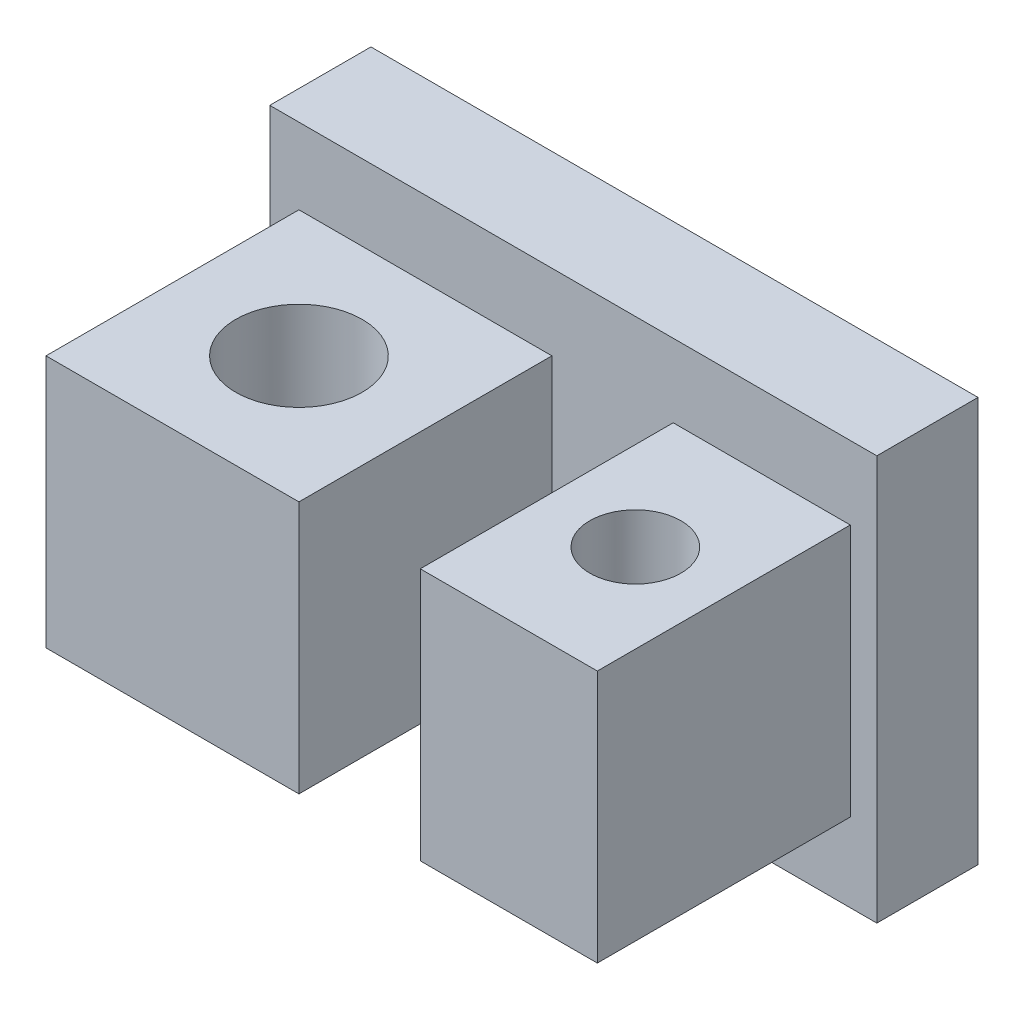
ISO-10303-21;
HEADER;
FILE_DESCRIPTION(('STEP AP214'),'2;1');
FILE_NAME('part.step','',(''),(''),'','','');
FILE_SCHEMA(('AUTOMOTIVE_DESIGN { 1 0 10303 214 1 1 1 1 }'));
ENDSEC;
DATA;
#1=APPLICATION_CONTEXT('core data for automotive mechanical design processes');
#2=APPLICATION_PROTOCOL_DEFINITION('international standard','automotive_design',2000,#1);
#3=PRODUCT_CONTEXT('',#1,'mechanical');
#4=PRODUCT('Part','Part','',(#3));
#5=PRODUCT_RELATED_PRODUCT_CATEGORY('part','',(#4));
#6=PRODUCT_DEFINITION_FORMATION('','',#4);
#7=PRODUCT_DEFINITION_CONTEXT('part definition',#1,'design');
#8=PRODUCT_DEFINITION('design','',#6,#7);
#9=PRODUCT_DEFINITION_SHAPE('','',#8);
#10=(LENGTH_UNIT() NAMED_UNIT(*) SI_UNIT(.MILLI.,.METRE.));
#11=(NAMED_UNIT(*) PLANE_ANGLE_UNIT() SI_UNIT($,.RADIAN.));
#12=(NAMED_UNIT(*) SI_UNIT($,.STERADIAN.) SOLID_ANGLE_UNIT());
#13=UNCERTAINTY_MEASURE_WITH_UNIT(LENGTH_MEASURE(1.E-05),#10,'distance_accuracy_value','');
#14=(GEOMETRIC_REPRESENTATION_CONTEXT(3) GLOBAL_UNCERTAINTY_ASSIGNED_CONTEXT((#13)) GLOBAL_UNIT_ASSIGNED_CONTEXT((#10,
#11,#12)) REPRESENTATION_CONTEXT('',''));
#15=CARTESIAN_POINT('',(0.,0.,0.));
#16=DIRECTION('',(0.,0.,1.));
#17=DIRECTION('',(1.,0.,0.));
#18=AXIS2_PLACEMENT_3D('',#15,#16,#17);
#19=CARTESIAN_POINT('',(0.,0.,2.));
#20=DIRECTION('',(0.,0.,1.));
#21=DIRECTION('',(1.,0.,0.));
#22=AXIS2_PLACEMENT_3D('',#19,#20,#21);
#23=PLANE('',#22);
#24=DIRECTION('',(0.,-1.,0.));
#25=VECTOR('',#24,1.);
#26=CARTESIAN_POINT('',(-4.5418108945163,4.02597402597402,2.));
#27=LINE('',#26,#25);
#28=CARTESIAN_POINT('',(-4.5418108945163,4.02597402597402,2.));
#29=VERTEX_POINT('',#28);
#30=CARTESIAN_POINT('',(-4.5418108945163,-3.97402597402598,2.));
#31=VERTEX_POINT('',#30);
#32=EDGE_CURVE('E227',#29,#31,#27,.T.);
#33=ORIENTED_EDGE('',*,*,#32,.T.);
#34=DIRECTION('',(1.,0.,0.));
#35=VECTOR('',#34,1.);
#36=CARTESIAN_POINT('',(-4.5418108945163,-3.97402597402598,2.));
#37=LINE('',#36,#35);
#38=CARTESIAN_POINT('',(7.4581891054837,-3.97402597402598,2.));
#39=VERTEX_POINT('',#38);
#40=EDGE_CURVE('E231',#31,#39,#37,.T.);
#41=ORIENTED_EDGE('',*,*,#40,.T.);
#42=DIRECTION('',(0.,1.,0.));
#43=VECTOR('',#42,1.);
#44=CARTESIAN_POINT('',(7.4581891054837,4.02597402597402,2.));
#45=LINE('',#44,#43);
#46=CARTESIAN_POINT('',(7.4581891054837,4.02597402597402,2.));
#47=VERTEX_POINT('',#46);
#48=EDGE_CURVE('E235',#39,#47,#45,.T.);
#49=ORIENTED_EDGE('',*,*,#48,.T.);
#50=DIRECTION('',(-1.,0.,0.));
#51=VECTOR('',#50,1.);
#52=CARTESIAN_POINT('',(-4.5418108945163,4.02597402597402,2.));
#53=LINE('',#52,#51);
#54=EDGE_CURVE('E238',#47,#29,#53,.T.);
#55=ORIENTED_EDGE('',*,*,#54,.T.);
#56=EDGE_LOOP('',(#33,#41,#49,#55));
#57=FACE_BOUND('',#56,.T.);
#58=DIRECTION('',(-1.,0.,0.));
#59=VECTOR('',#58,1.);
#60=CARTESIAN_POINT('',(0.,-2.47402597402598,2.));
#61=LINE('',#60,#59);
#62=CARTESIAN_POINT('',(1.03498241264621,-2.47402597402598,2.));
#63=VERTEX_POINT('',#62);
#64=CARTESIAN_POINT('',(-3.96501758735379,-2.47402597402598,2.));
#65=VERTEX_POINT('',#64);
#66=EDGE_CURVE('E218',#63,#65,#61,.T.);
#67=ORIENTED_EDGE('',*,*,#66,.T.);
#68=DIRECTION('',(0.,1.,0.));
#69=VECTOR('',#68,1.);
#70=CARTESIAN_POINT('',(-3.96501758735379,0.,2.));
#71=LINE('',#70,#69);
#72=CARTESIAN_POINT('',(-3.96501758735379,2.52597402597402,2.));
#73=VERTEX_POINT('',#72);
#74=EDGE_CURVE('E222',#65,#73,#71,.T.);
#75=ORIENTED_EDGE('',*,*,#74,.T.);
#76=DIRECTION('',(1.,0.,0.));
#77=VECTOR('',#76,1.);
#78=CARTESIAN_POINT('',(0.,2.52597402597402,2.));
#79=LINE('',#78,#77);
#80=CARTESIAN_POINT('',(1.03498241264621,2.52597402597402,2.));
#81=VERTEX_POINT('',#80);
#82=EDGE_CURVE('E210',#73,#81,#79,.T.);
#83=ORIENTED_EDGE('',*,*,#82,.T.);
#84=DIRECTION('',(0.,-1.,0.));
#85=VECTOR('',#84,1.);
#86=CARTESIAN_POINT('',(1.03498241264621,0.,2.));
#87=LINE('',#86,#85);
#88=EDGE_CURVE('E214',#81,#63,#87,.T.);
#89=ORIENTED_EDGE('',*,*,#88,.T.);
#90=EDGE_LOOP('',(#67,#75,#83,#89));
#91=FACE_BOUND('',#90,.T.);
#92=DIRECTION('',(-1.,0.,0.));
#93=VECTOR('',#92,1.);
#94=CARTESIAN_POINT('',(0.,-2.42083758937694,2.));
#95=LINE('',#94,#93);
#96=CARTESIAN_POINT('',(6.93313614151237,-2.42083758937694,2.));
#97=VERTEX_POINT('',#96);
#98=CARTESIAN_POINT('',(3.43313614151236,-2.42083758937694,2.));
#99=VERTEX_POINT('',#98);
#100=EDGE_CURVE('E173',#97,#99,#95,.T.);
#101=ORIENTED_EDGE('',*,*,#100,.T.);
#102=DIRECTION('',(0.,1.,0.));
#103=VECTOR('',#102,1.);
#104=CARTESIAN_POINT('',(3.43313614151236,0.,2.));
#105=LINE('',#104,#103);
#106=CARTESIAN_POINT('',(3.43313614151236,2.57916241062306,2.));
#107=VERTEX_POINT('',#106);
#108=EDGE_CURVE('E158',#99,#107,#105,.T.);
#109=ORIENTED_EDGE('',*,*,#108,.T.);
#110=DIRECTION('',(1.,0.,0.));
#111=VECTOR('',#110,1.);
#112=CARTESIAN_POINT('',(0.,2.57916241062306,2.));
#113=LINE('',#112,#111);
#114=CARTESIAN_POINT('',(6.93313614151236,2.57916241062306,2.));
#115=VERTEX_POINT('',#114);
#116=EDGE_CURVE('E160',#107,#115,#113,.T.);
#117=ORIENTED_EDGE('',*,*,#116,.T.);
#118=DIRECTION('',(0.,-1.,0.));
#119=VECTOR('',#118,1.);
#120=CARTESIAN_POINT('',(6.93313614151236,0.,2.));
#121=LINE('',#120,#119);
#122=EDGE_CURVE('E165',#115,#97,#121,.T.);
#123=ORIENTED_EDGE('',*,*,#122,.T.);
#124=EDGE_LOOP('',(#101,#109,#117,#123));
#125=FACE_BOUND('',#124,.T.);
#126=ADVANCED_FACE('F39',(#57,#91,#125),#23,.T.);
#127=CARTESIAN_POINT('',(-4.5418108945163,4.02597402597402,2.));
#128=DIRECTION('',(1.,0.,0.));
#129=DIRECTION('',(0.,1.,0.));
#130=AXIS2_PLACEMENT_3D('',#127,#128,#129);
#131=PLANE('',#130);
#132=DIRECTION('',(0.,-1.,0.));
#133=VECTOR('',#132,1.);
#134=CARTESIAN_POINT('',(-4.5418108945163,4.02597402597402,0.));
#135=LINE('',#134,#133);
#136=CARTESIAN_POINT('',(-4.5418108945163,4.02597402597402,0.));
#137=VERTEX_POINT('',#136);
#138=CARTESIAN_POINT('',(-4.5418108945163,-3.97402597402598,0.));
#139=VERTEX_POINT('',#138);
#140=EDGE_CURVE('E226',#137,#139,#135,.T.);
#141=ORIENTED_EDGE('',*,*,#140,.T.);
#142=DIRECTION('',(0.,0.,-1.));
#143=VECTOR('',#142,1.);
#144=CARTESIAN_POINT('',(-4.5418108945163,-3.97402597402598,2.));
#145=LINE('',#144,#143);
#146=EDGE_CURVE('E11',#31,#139,#145,.T.);
#147=ORIENTED_EDGE('',*,*,#146,.F.);
#148=ORIENTED_EDGE('',*,*,#32,.F.);
#149=DIRECTION('',(0.,0.,-1.));
#150=VECTOR('',#149,1.);
#151=CARTESIAN_POINT('',(-4.5418108945163,4.02597402597402,2.));
#152=LINE('',#151,#150);
#153=EDGE_CURVE('E241',#29,#137,#152,.T.);
#154=ORIENTED_EDGE('',*,*,#153,.T.);
#155=EDGE_LOOP('',(#141,#147,#148,#154));
#156=FACE_BOUND('',#155,.T.);
#157=ADVANCED_FACE('F41',(#156),#131,.F.);
#158=CARTESIAN_POINT('',(-4.5418108945163,-3.97402597402598,2.));
#159=DIRECTION('',(0.,1.,0.));
#160=DIRECTION('',(0.,0.,1.));
#161=AXIS2_PLACEMENT_3D('',#158,#159,#160);
#162=PLANE('',#161);
#163=DIRECTION('',(1.,0.,0.));
#164=VECTOR('',#163,1.);
#165=CARTESIAN_POINT('',(-4.5418108945163,-3.97402597402598,0.));
#166=LINE('',#165,#164);
#167=CARTESIAN_POINT('',(7.4581891054837,-3.97402597402598,0.));
#168=VERTEX_POINT('',#167);
#169=EDGE_CURVE('E245',#139,#168,#166,.T.);
#170=ORIENTED_EDGE('',*,*,#169,.T.);
#171=DIRECTION('',(0.,0.,-1.));
#172=VECTOR('',#171,1.);
#173=CARTESIAN_POINT('',(7.4581891054837,-3.97402597402598,2.));
#174=LINE('',#173,#172);
#175=EDGE_CURVE('E49',#39,#168,#174,.T.);
#176=ORIENTED_EDGE('',*,*,#175,.F.);
#177=ORIENTED_EDGE('',*,*,#40,.F.);
#178=ORIENTED_EDGE('',*,*,#146,.T.);
#179=EDGE_LOOP('',(#170,#176,#177,#178));
#180=FACE_BOUND('',#179,.T.);
#181=ADVANCED_FACE('F299',(#180),#162,.F.);
#182=CARTESIAN_POINT('',(7.4581891054837,4.02597402597402,2.));
#183=DIRECTION('',(-1.,0.,0.));
#184=DIRECTION('',(0.,-1.,0.));
#185=AXIS2_PLACEMENT_3D('',#182,#183,#184);
#186=PLANE('',#185);
#187=DIRECTION('',(0.,1.,0.));
#188=VECTOR('',#187,1.);
#189=CARTESIAN_POINT('',(7.4581891054837,4.02597402597402,0.));
#190=LINE('',#189,#188);
#191=CARTESIAN_POINT('',(7.4581891054837,4.02597402597402,0.));
#192=VERTEX_POINT('',#191);
#193=EDGE_CURVE('E248',#168,#192,#190,.T.);
#194=ORIENTED_EDGE('',*,*,#193,.T.);
#195=DIRECTION('',(0.,0.,-1.));
#196=VECTOR('',#195,1.);
#197=CARTESIAN_POINT('',(7.4581891054837,4.02597402597402,2.));
#198=LINE('',#197,#196);
#199=EDGE_CURVE('E256',#47,#192,#198,.T.);
#200=ORIENTED_EDGE('',*,*,#199,.F.);
#201=ORIENTED_EDGE('',*,*,#48,.F.);
#202=ORIENTED_EDGE('',*,*,#175,.T.);
#203=EDGE_LOOP('',(#194,#200,#201,#202));
#204=FACE_BOUND('',#203,.T.);
#205=ADVANCED_FACE('F311',(#204),#186,.F.);
#206=CARTESIAN_POINT('',(-4.5418108945163,4.02597402597402,2.));
#207=DIRECTION('',(0.,-1.,0.));
#208=DIRECTION('',(0.,0.,-1.));
#209=AXIS2_PLACEMENT_3D('',#206,#207,#208);
#210=PLANE('',#209);
#211=DIRECTION('',(-1.,0.,0.));
#212=VECTOR('',#211,1.);
#213=CARTESIAN_POINT('',(-4.5418108945163,4.02597402597402,0.));
#214=LINE('',#213,#212);
#215=EDGE_CURVE('E232',#192,#137,#214,.T.);
#216=ORIENTED_EDGE('',*,*,#215,.T.);
#217=ORIENTED_EDGE('',*,*,#153,.F.);
#218=ORIENTED_EDGE('',*,*,#54,.F.);
#219=ORIENTED_EDGE('',*,*,#199,.T.);
#220=EDGE_LOOP('',(#216,#217,#218,#219));
#221=FACE_BOUND('',#220,.T.);
#222=ADVANCED_FACE('F307',(#221),#210,.F.);
#223=CARTESIAN_POINT('',(0.,0.,0.));
#224=DIRECTION('',(0.,0.,1.));
#225=DIRECTION('',(1.,0.,0.));
#226=AXIS2_PLACEMENT_3D('',#223,#224,#225);
#227=PLANE('',#226);
#228=ORIENTED_EDGE('',*,*,#140,.F.);
#229=ORIENTED_EDGE('',*,*,#215,.F.);
#230=ORIENTED_EDGE('',*,*,#193,.F.);
#231=ORIENTED_EDGE('',*,*,#169,.F.);
#232=EDGE_LOOP('',(#228,#229,#230,#231));
#233=FACE_BOUND('',#232,.T.);
#234=ADVANCED_FACE('F304',(#233),#227,.F.);
#235=CARTESIAN_POINT('',(-3.96501758735379,2.52597402597402,7.));
#236=DIRECTION('',(1.,0.,0.));
#237=DIRECTION('',(0.,0.,-1.));
#238=AXIS2_PLACEMENT_3D('',#235,#236,#237);
#239=PLANE('',#238);
#240=ORIENTED_EDGE('',*,*,#74,.F.);
#241=DIRECTION('',(0.,0.,-1.));
#242=VECTOR('',#241,1.);
#243=CARTESIAN_POINT('',(-3.96501758735379,-2.47402597402598,7.));
#244=LINE('',#243,#242);
#245=CARTESIAN_POINT('',(-3.96501758735379,-2.47402597402598,7.));
#246=VERTEX_POINT('',#245);
#247=EDGE_CURVE('E206',#246,#65,#244,.T.);
#248=ORIENTED_EDGE('',*,*,#247,.F.);
#249=DIRECTION('',(0.,-1.,0.));
#250=VECTOR('',#249,1.);
#251=CARTESIAN_POINT('',(-3.96501758735379,2.52597402597402,7.));
#252=LINE('',#251,#250);
#253=CARTESIAN_POINT('',(-3.96501758735379,2.52597402597402,7.));
#254=VERTEX_POINT('',#253);
#255=EDGE_CURVE('E183',#254,#246,#252,.T.);
#256=ORIENTED_EDGE('',*,*,#255,.F.);
#257=DIRECTION('',(0.,0.,-1.));
#258=VECTOR('',#257,1.);
#259=CARTESIAN_POINT('',(-3.96501758735379,2.52597402597402,7.));
#260=LINE('',#259,#258);
#261=EDGE_CURVE('E196',#254,#73,#260,.T.);
#262=ORIENTED_EDGE('',*,*,#261,.T.);
#263=EDGE_LOOP('',(#240,#248,#256,#262));
#264=FACE_BOUND('',#263,.T.);
#265=ADVANCED_FACE('F278',(#264),#239,.F.);
#266=CARTESIAN_POINT('',(-3.96501758735379,-2.47402597402598,7.));
#267=DIRECTION('',(0.,1.,0.));
#268=DIRECTION('',(0.,0.,1.));
#269=AXIS2_PLACEMENT_3D('',#266,#267,#268);
#270=PLANE('',#269);
#271=CARTESIAN_POINT('',(-1.46501758735379,-2.47402597402598,4.5));
#272=DIRECTION('',(0.,1.,0.));
#273=DIRECTION('',(0.,0.,1.));
#274=AXIS2_PLACEMENT_3D('',#271,#272,#273);
#275=CIRCLE('',#274,1.25);
#276=CARTESIAN_POINT('',(-1.46501758735379,-2.47402597402598,5.75));
#277=VERTEX_POINT('',#276);
#278=EDGE_CURVE('E179',#277,#277,#275,.F.);
#279=ORIENTED_EDGE('',*,*,#278,.F.);
#280=EDGE_LOOP('',(#279));
#281=FACE_BOUND('',#280,.T.);
#282=ORIENTED_EDGE('',*,*,#66,.F.);
#283=DIRECTION('',(0.,0.,-1.));
#284=VECTOR('',#283,1.);
#285=CARTESIAN_POINT('',(1.03498241264621,-2.47402597402598,7.));
#286=LINE('',#285,#284);
#287=CARTESIAN_POINT('',(1.03498241264621,-2.47402597402598,7.));
#288=VERTEX_POINT('',#287);
#289=EDGE_CURVE('E202',#288,#63,#286,.T.);
#290=ORIENTED_EDGE('',*,*,#289,.F.);
#291=DIRECTION('',(1.,0.,0.));
#292=VECTOR('',#291,1.);
#293=CARTESIAN_POINT('',(-3.96501758735379,-2.47402597402598,7.));
#294=LINE('',#293,#292);
#295=EDGE_CURVE('E187',#246,#288,#294,.T.);
#296=ORIENTED_EDGE('',*,*,#295,.F.);
#297=ORIENTED_EDGE('',*,*,#247,.T.);
#298=EDGE_LOOP('',(#282,#290,#296,#297));
#299=FACE_BOUND('',#298,.T.);
#300=ADVANCED_FACE('F283',(#281,#299),#270,.F.);
#301=CARTESIAN_POINT('',(1.03498241264621,2.52597402597402,7.));
#302=DIRECTION('',(-1.,0.,0.));
#303=DIRECTION('',(0.,0.,1.));
#304=AXIS2_PLACEMENT_3D('',#301,#302,#303);
#305=PLANE('',#304);
#306=ORIENTED_EDGE('',*,*,#88,.F.);
#307=DIRECTION('',(0.,0.,-1.));
#308=VECTOR('',#307,1.);
#309=CARTESIAN_POINT('',(1.03498241264621,2.52597402597402,7.));
#310=LINE('',#309,#308);
#311=CARTESIAN_POINT('',(1.03498241264621,2.52597402597402,7.));
#312=VERTEX_POINT('',#311);
#313=EDGE_CURVE('E65',#312,#81,#310,.T.);
#314=ORIENTED_EDGE('',*,*,#313,.F.);
#315=DIRECTION('',(0.,1.,0.));
#316=VECTOR('',#315,1.);
#317=CARTESIAN_POINT('',(1.03498241264621,2.52597402597402,7.));
#318=LINE('',#317,#316);
#319=EDGE_CURVE('E190',#288,#312,#318,.T.);
#320=ORIENTED_EDGE('',*,*,#319,.F.);
#321=ORIENTED_EDGE('',*,*,#289,.T.);
#322=EDGE_LOOP('',(#306,#314,#320,#321));
#323=FACE_BOUND('',#322,.T.);
#324=ADVANCED_FACE('F272',(#323),#305,.F.);
#325=CARTESIAN_POINT('',(-3.96501758735379,2.52597402597402,7.));
#326=DIRECTION('',(0.,-1.,0.));
#327=DIRECTION('',(0.,0.,-1.));
#328=AXIS2_PLACEMENT_3D('',#325,#326,#327);
#329=PLANE('',#328);
#330=CARTESIAN_POINT('',(-1.46501758735379,2.52597402597402,4.5));
#331=DIRECTION('',(0.,-1.,0.));
#332=DIRECTION('',(0.,0.,-1.));
#333=AXIS2_PLACEMENT_3D('',#330,#331,#332);
#334=CIRCLE('',#333,1.25);
#335=CARTESIAN_POINT('',(-1.46501758735379,2.52597402597402,3.25));
#336=VERTEX_POINT('',#335);
#337=EDGE_CURVE('E178',#336,#336,#334,.F.);
#338=ORIENTED_EDGE('',*,*,#337,.F.);
#339=EDGE_LOOP('',(#338));
#340=FACE_BOUND('',#339,.T.);
#341=ORIENTED_EDGE('',*,*,#82,.F.);
#342=ORIENTED_EDGE('',*,*,#261,.F.);
#343=DIRECTION('',(-1.,0.,0.));
#344=VECTOR('',#343,1.);
#345=CARTESIAN_POINT('',(-3.96501758735379,2.52597402597402,7.));
#346=LINE('',#345,#344);
#347=EDGE_CURVE('E193',#312,#254,#346,.T.);
#348=ORIENTED_EDGE('',*,*,#347,.F.);
#349=ORIENTED_EDGE('',*,*,#313,.T.);
#350=EDGE_LOOP('',(#341,#342,#348,#349));
#351=FACE_BOUND('',#350,.T.);
#352=ADVANCED_FACE('F269',(#340,#351),#329,.F.);
#353=CARTESIAN_POINT('',(0.,0.,7.));
#354=DIRECTION('',(0.,0.,1.));
#355=DIRECTION('',(1.,0.,0.));
#356=AXIS2_PLACEMENT_3D('',#353,#354,#355);
#357=PLANE('',#356);
#358=ORIENTED_EDGE('',*,*,#255,.T.);
#359=ORIENTED_EDGE('',*,*,#295,.T.);
#360=ORIENTED_EDGE('',*,*,#319,.T.);
#361=ORIENTED_EDGE('',*,*,#347,.T.);
#362=EDGE_LOOP('',(#358,#359,#360,#361));
#363=FACE_BOUND('',#362,.T.);
#364=ADVANCED_FACE('F271',(#363),#357,.T.);
#365=CARTESIAN_POINT('',(-1.46501758735379,5.,4.5));
#366=DIRECTION('',(0.,-1.,0.));
#367=DIRECTION('',(0.,0.,-1.));
#368=AXIS2_PLACEMENT_3D('',#365,#366,#367);
#369=CYLINDRICAL_SURFACE('',#368,1.25);
#370=ORIENTED_EDGE('',*,*,#337,.T.);
#371=EDGE_LOOP('',(#370));
#372=FACE_BOUND('',#371,.T.);
#373=ORIENTED_EDGE('',*,*,#278,.T.);
#374=EDGE_LOOP('',(#373));
#375=FACE_BOUND('',#374,.T.);
#376=ADVANCED_FACE('F266',(#372,#375),#369,.F.);
#377=CARTESIAN_POINT('',(3.43313614151236,2.57916241062306,7.));
#378=DIRECTION('',(1.,0.,0.));
#379=DIRECTION('',(0.,1.,0.));
#380=AXIS2_PLACEMENT_3D('',#377,#378,#379);
#381=PLANE('',#380);
#382=ORIENTED_EDGE('',*,*,#108,.F.);
#383=DIRECTION('',(0.,0.,-1.));
#384=VECTOR('',#383,1.);
#385=CARTESIAN_POINT('',(3.43313614151236,-2.42083758937694,7.));
#386=LINE('',#385,#384);
#387=CARTESIAN_POINT('',(3.43313614151236,-2.42083758937694,7.));
#388=VERTEX_POINT('',#387);
#389=EDGE_CURVE('E137',#388,#99,#386,.T.);
#390=ORIENTED_EDGE('',*,*,#389,.F.);
#391=DIRECTION('',(0.,-1.,0.));
#392=VECTOR('',#391,1.);
#393=CARTESIAN_POINT('',(3.43313614151236,2.57916241062306,7.));
#394=LINE('',#393,#392);
#395=CARTESIAN_POINT('',(3.43313614151236,2.57916241062306,7.));
#396=VERTEX_POINT('',#395);
#397=EDGE_CURVE('E145',#396,#388,#394,.T.);
#398=ORIENTED_EDGE('',*,*,#397,.F.);
#399=DIRECTION('',(0.,0.,-1.));
#400=VECTOR('',#399,1.);
#401=CARTESIAN_POINT('',(3.43313614151236,2.57916241062306,7.));
#402=LINE('',#401,#400);
#403=EDGE_CURVE('E447',#396,#107,#402,.T.);
#404=ORIENTED_EDGE('',*,*,#403,.T.);
#405=EDGE_LOOP('',(#382,#390,#398,#404));
#406=FACE_BOUND('',#405,.T.);
#407=ADVANCED_FACE('F156',(#406),#381,.F.);
#408=CARTESIAN_POINT('',(3.43313614151236,-2.42083758937694,7.));
#409=DIRECTION('',(0.,1.,0.));
#410=DIRECTION('',(0.,0.,1.));
#411=AXIS2_PLACEMENT_3D('',#408,#409,#410);
#412=PLANE('',#411);
#413=CARTESIAN_POINT('',(5.18498241264621,-2.42083758937694,4.5));
#414=DIRECTION('',(0.,1.,0.));
#415=DIRECTION('',(0.,0.,1.));
#416=AXIS2_PLACEMENT_3D('',#413,#414,#415);
#417=CIRCLE('',#416,0.899999999999999);
#418=CARTESIAN_POINT('',(5.18498241264621,-2.42083758937694,5.4));
#419=VERTEX_POINT('',#418);
#420=EDGE_CURVE('E154',#419,#419,#417,.F.);
#421=ORIENTED_EDGE('',*,*,#420,.F.);
#422=EDGE_LOOP('',(#421));
#423=FACE_BOUND('',#422,.T.);
#424=ORIENTED_EDGE('',*,*,#100,.F.);
#425=DIRECTION('',(0.,0.,-1.));
#426=VECTOR('',#425,1.);
#427=CARTESIAN_POINT('',(6.93313614151237,-2.42083758937694,7.));
#428=LINE('',#427,#426);
#429=CARTESIAN_POINT('',(6.93313614151237,-2.42083758937694,7.));
#430=VERTEX_POINT('',#429);
#431=EDGE_CURVE('E140',#430,#97,#428,.T.);
#432=ORIENTED_EDGE('',*,*,#431,.F.);
#433=DIRECTION('',(1.,0.,0.));
#434=VECTOR('',#433,1.);
#435=CARTESIAN_POINT('',(3.43313614151236,-2.42083758937694,7.));
#436=LINE('',#435,#434);
#437=EDGE_CURVE('E133',#388,#430,#436,.T.);
#438=ORIENTED_EDGE('',*,*,#437,.F.);
#439=ORIENTED_EDGE('',*,*,#389,.T.);
#440=EDGE_LOOP('',(#424,#432,#438,#439));
#441=FACE_BOUND('',#440,.T.);
#442=ADVANCED_FACE('F135',(#423,#441),#412,.F.);
#443=CARTESIAN_POINT('',(6.93313614151236,2.57916241062306,7.));
#444=DIRECTION('',(-1.,0.,0.));
#445=DIRECTION('',(0.,-1.,0.));
#446=AXIS2_PLACEMENT_3D('',#443,#444,#445);
#447=PLANE('',#446);
#448=ORIENTED_EDGE('',*,*,#122,.F.);
#449=DIRECTION('',(0.,0.,-1.));
#450=VECTOR('',#449,1.);
#451=CARTESIAN_POINT('',(6.93313614151236,2.57916241062306,7.));
#452=LINE('',#451,#450);
#453=CARTESIAN_POINT('',(6.93313614151236,2.57916241062306,7.));
#454=VERTEX_POINT('',#453);
#455=EDGE_CURVE('E57',#454,#115,#452,.T.);
#456=ORIENTED_EDGE('',*,*,#455,.F.);
#457=DIRECTION('',(0.,1.,0.));
#458=VECTOR('',#457,1.);
#459=CARTESIAN_POINT('',(6.93313614151236,2.57916241062306,7.));
#460=LINE('',#459,#458);
#461=EDGE_CURVE('E144',#430,#454,#460,.T.);
#462=ORIENTED_EDGE('',*,*,#461,.F.);
#463=ORIENTED_EDGE('',*,*,#431,.T.);
#464=EDGE_LOOP('',(#448,#456,#462,#463));
#465=FACE_BOUND('',#464,.T.);
#466=ADVANCED_FACE('F393',(#465),#447,.F.);
#467=CARTESIAN_POINT('',(3.43313614151236,2.57916241062306,7.));
#468=DIRECTION('',(0.,-1.,0.));
#469=DIRECTION('',(0.,0.,-1.));
#470=AXIS2_PLACEMENT_3D('',#467,#468,#469);
#471=PLANE('',#470);
#472=CARTESIAN_POINT('',(5.18498241264621,2.57916241062306,4.5));
#473=DIRECTION('',(0.,-1.,0.));
#474=DIRECTION('',(0.,0.,-1.));
#475=AXIS2_PLACEMENT_3D('',#472,#473,#474);
#476=CIRCLE('',#475,0.899999999999999);
#477=CARTESIAN_POINT('',(5.18498241264621,2.57916241062306,3.6));
#478=VERTEX_POINT('',#477);
#479=EDGE_CURVE('E43',#478,#478,#476,.F.);
#480=ORIENTED_EDGE('',*,*,#479,.F.);
#481=EDGE_LOOP('',(#480));
#482=FACE_BOUND('',#481,.T.);
#483=ORIENTED_EDGE('',*,*,#116,.F.);
#484=ORIENTED_EDGE('',*,*,#403,.F.);
#485=DIRECTION('',(-1.,0.,0.));
#486=VECTOR('',#485,1.);
#487=CARTESIAN_POINT('',(3.43313614151236,2.57916241062306,7.));
#488=LINE('',#487,#486);
#489=EDGE_CURVE('E149',#454,#396,#488,.T.);
#490=ORIENTED_EDGE('',*,*,#489,.F.);
#491=ORIENTED_EDGE('',*,*,#455,.T.);
#492=EDGE_LOOP('',(#483,#484,#490,#491));
#493=FACE_BOUND('',#492,.T.);
#494=ADVANCED_FACE('F403',(#482,#493),#471,.F.);
#495=CARTESIAN_POINT('',(0.,0.,7.));
#496=DIRECTION('',(0.,0.,1.));
#497=DIRECTION('',(1.,0.,0.));
#498=AXIS2_PLACEMENT_3D('',#495,#496,#497);
#499=PLANE('',#498);
#500=ORIENTED_EDGE('',*,*,#397,.T.);
#501=ORIENTED_EDGE('',*,*,#437,.T.);
#502=ORIENTED_EDGE('',*,*,#461,.T.);
#503=ORIENTED_EDGE('',*,*,#489,.T.);
#504=EDGE_LOOP('',(#500,#501,#502,#503));
#505=FACE_BOUND('',#504,.T.);
#506=ADVANCED_FACE('F148',(#505),#499,.T.);
#507=CARTESIAN_POINT('',(5.18498241264621,7.,4.5));
#508=DIRECTION('',(0.,-1.,0.));
#509=DIRECTION('',(0.,0.,-1.));
#510=AXIS2_PLACEMENT_3D('',#507,#508,#509);
#511=CYLINDRICAL_SURFACE('',#510,0.899999999999999);
#512=ORIENTED_EDGE('',*,*,#479,.T.);
#513=EDGE_LOOP('',(#512));
#514=FACE_BOUND('',#513,.T.);
#515=ORIENTED_EDGE('',*,*,#420,.T.);
#516=EDGE_LOOP('',(#515));
#517=FACE_BOUND('',#516,.T.);
#518=ADVANCED_FACE('F419',(#514,#517),#511,.F.);
#519=CLOSED_SHELL('',(#126,#157,#181,#205,#222,#234,#265,#300,#324,#352,#364,#376,#407,#442,
#466,#494,#506,#518));
#520=MANIFOLD_SOLID_BREP('B2',#519);
#521=ADVANCED_BREP_SHAPE_REPRESENTATION('',(#18,#520),#14);
#522=SHAPE_DEFINITION_REPRESENTATION(#9,#521);
ENDSEC;
END-ISO-10303-21;
